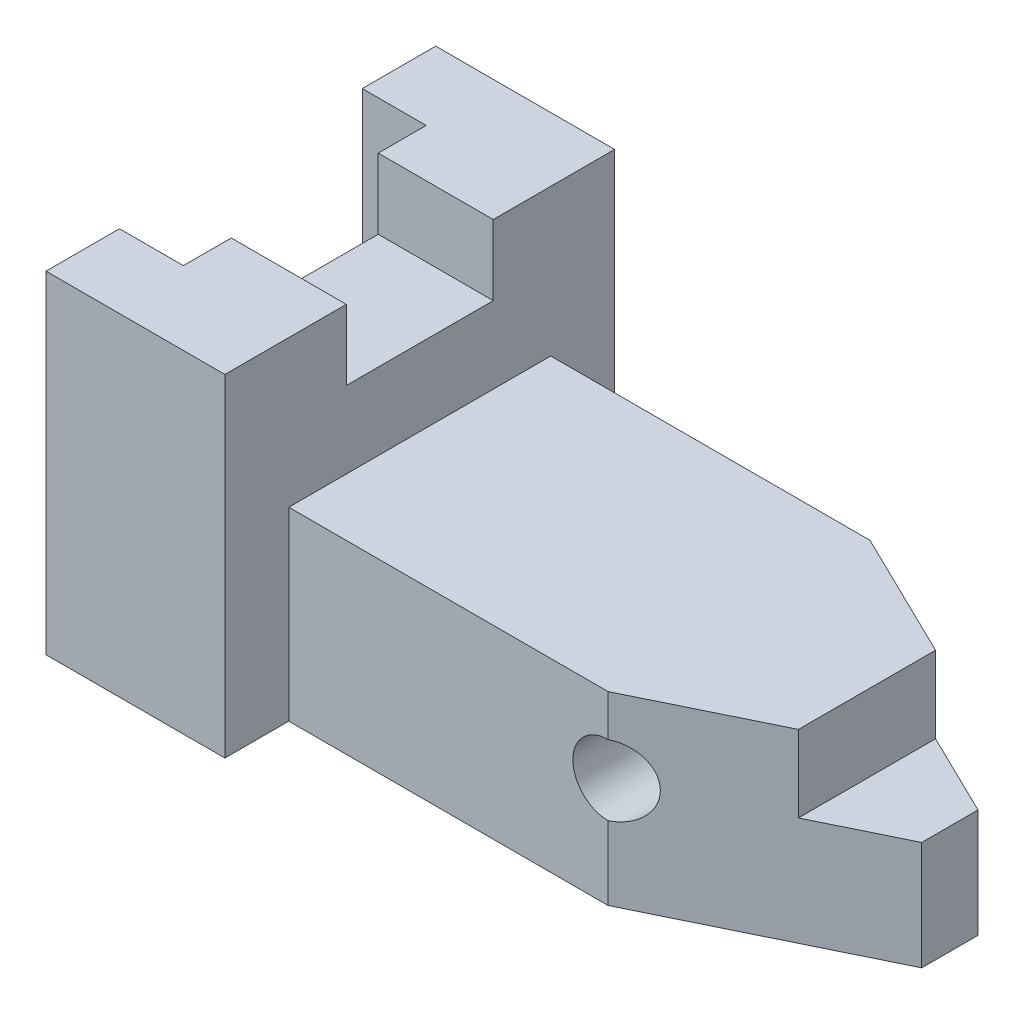
ISO-10303-21;
HEADER;
FILE_DESCRIPTION(('STEP AP214'),'2;1');
FILE_NAME('part.step','',(''),(''),'','','');
FILE_SCHEMA(('AUTOMOTIVE_DESIGN { 1 0 10303 214 1 1 1 1 }'));
ENDSEC;
DATA;
#1=APPLICATION_CONTEXT('core data for automotive mechanical design processes');
#2=APPLICATION_PROTOCOL_DEFINITION('international standard','automotive_design',2000,#1);
#3=PRODUCT_CONTEXT('',#1,'mechanical');
#4=PRODUCT('Part','Part','',(#3));
#5=PRODUCT_RELATED_PRODUCT_CATEGORY('part','',(#4));
#6=PRODUCT_DEFINITION_FORMATION('','',#4);
#7=PRODUCT_DEFINITION_CONTEXT('part definition',#1,'design');
#8=PRODUCT_DEFINITION('design','',#6,#7);
#9=PRODUCT_DEFINITION_SHAPE('','',#8);
#10=(LENGTH_UNIT() NAMED_UNIT(*) SI_UNIT(.MILLI.,.METRE.));
#11=(NAMED_UNIT(*) PLANE_ANGLE_UNIT() SI_UNIT($,.RADIAN.));
#12=(NAMED_UNIT(*) SI_UNIT($,.STERADIAN.) SOLID_ANGLE_UNIT());
#13=UNCERTAINTY_MEASURE_WITH_UNIT(LENGTH_MEASURE(1.E-05),#10,'distance_accuracy_value','');
#14=(GEOMETRIC_REPRESENTATION_CONTEXT(3) GLOBAL_UNCERTAINTY_ASSIGNED_CONTEXT((#13)) GLOBAL_UNIT_ASSIGNED_CONTEXT((#10,
#11,#12)) REPRESENTATION_CONTEXT('',''));
#15=CARTESIAN_POINT('',(0.,0.,0.));
#16=DIRECTION('',(0.,0.,1.));
#17=DIRECTION('',(1.,0.,0.));
#18=AXIS2_PLACEMENT_3D('',#15,#16,#17);
#19=CARTESIAN_POINT('',(0.,41.,0.));
#20=DIRECTION('',(0.,1.,0.));
#21=DIRECTION('',(0.,0.,1.));
#22=AXIS2_PLACEMENT_3D('',#19,#20,#21);
#23=PLANE('',#22);
#24=DIRECTION('',(0.,0.,1.));
#25=VECTOR('',#24,1.);
#26=CARTESIAN_POINT('',(28.,41.,0.));
#27=LINE('',#26,#25);
#28=CARTESIAN_POINT('',(28.,41.,-11.5));
#29=VERTEX_POINT('',#28);
#30=CARTESIAN_POINT('',(28.,41.,11.5));
#31=VERTEX_POINT('',#30);
#32=EDGE_CURVE('E264',#29,#31,#27,.T.);
#33=ORIENTED_EDGE('',*,*,#32,.F.);
#34=DIRECTION('',(-1.,0.,0.));
#35=VECTOR('',#34,1.);
#36=CARTESIAN_POINT('',(0.,41.,-11.5));
#37=LINE('',#36,#35);
#38=CARTESIAN_POINT('',(10.,41.,-11.5));
#39=VERTEX_POINT('',#38);
#40=EDGE_CURVE('E54',#29,#39,#37,.T.);
#41=ORIENTED_EDGE('',*,*,#40,.T.);
#42=DIRECTION('',(0.,0.,-1.));
#43=VECTOR('',#42,1.);
#44=CARTESIAN_POINT('',(10.,41.,0.));
#45=LINE('',#44,#43);
#46=CARTESIAN_POINT('',(10.,41.,11.5));
#47=VERTEX_POINT('',#46);
#48=EDGE_CURVE('E263',#47,#39,#45,.T.);
#49=ORIENTED_EDGE('',*,*,#48,.F.);
#50=DIRECTION('',(-1.,0.,0.));
#51=VECTOR('',#50,1.);
#52=CARTESIAN_POINT('',(0.,41.,11.5));
#53=LINE('',#52,#51);
#54=EDGE_CURVE('E255',#31,#47,#53,.T.);
#55=ORIENTED_EDGE('',*,*,#54,.F.);
#56=EDGE_LOOP('',(#33,#41,#49,#55));
#57=FACE_BOUND('',#56,.T.);
#58=ADVANCED_FACE('F45',(#57),#23,.T.);
#59=CARTESIAN_POINT('',(0.,17.,0.));
#60=DIRECTION('',(0.,1.,0.));
#61=DIRECTION('',(0.,0.,1.));
#62=AXIS2_PLACEMENT_3D('',#59,#60,#61);
#63=PLANE('',#62);
#64=DIRECTION('',(-0.898794046299166,0.,-0.438371146789079));
#65=VECTOR('',#64,1.);
#66=CARTESIAN_POINT('',(23.0603114804606,17.,-47.2806452164034));
#67=LINE('',#66,#65);
#68=CARTESIAN_POINT('',(110.968771247625,17.,-4.40482457732652));
#69=VERTEX_POINT('',#68);
#70=CARTESIAN_POINT('',(98.,17.,-10.730116948449));
#71=VERTEX_POINT('',#70);
#72=EDGE_CURVE('E358',#69,#71,#67,.T.);
#73=ORIENTED_EDGE('',*,*,#72,.T.);
#74=DIRECTION('',(0.,0.,1.));
#75=VECTOR('',#74,1.);
#76=CARTESIAN_POINT('',(98.,17.,0.));
#77=LINE('',#76,#75);
#78=CARTESIAN_POINT('',(98.,17.,10.730116948449));
#79=VERTEX_POINT('',#78);
#80=EDGE_CURVE('E345',#71,#79,#77,.T.);
#81=ORIENTED_EDGE('',*,*,#80,.T.);
#82=DIRECTION('',(-0.898794046299166,0.,0.438371146789079));
#83=VECTOR('',#82,1.);
#84=CARTESIAN_POINT('',(23.0603114804606,17.,47.2806452164034));
#85=LINE('',#84,#83);
#86=CARTESIAN_POINT('',(110.968771247625,17.,4.40482457732652));
#87=VERTEX_POINT('',#86);
#88=EDGE_CURVE('E349',#87,#79,#85,.T.);
#89=ORIENTED_EDGE('',*,*,#88,.F.);
#90=DIRECTION('',(0.,0.,1.));
#91=VECTOR('',#90,1.);
#92=CARTESIAN_POINT('',(110.968771247625,17.,0.));
#93=LINE('',#92,#91);
#94=EDGE_CURVE('E353',#69,#87,#93,.T.);
#95=ORIENTED_EDGE('',*,*,#94,.F.);
#96=EDGE_LOOP('',(#73,#81,#89,#95));
#97=FACE_BOUND('',#96,.T.);
#98=ADVANCED_FACE('F497',(#97),#63,.T.);
#99=CARTESIAN_POINT('',(0.,17.,-20.5));
#100=DIRECTION('',(0.,0.,-1.));
#101=DIRECTION('',(-1.,0.,0.));
#102=AXIS2_PLACEMENT_3D('',#99,#100,#101);
#103=PLANE('',#102);
#104=CARTESIAN_POINT('',(77.9687712476245,17.,-20.5));
#105=DIRECTION('',(0.,0.,-1.));
#106=DIRECTION('',(-1.,0.,0.));
#107=AXIS2_PLACEMENT_3D('',#104,#105,#106);
#108=CIRCLE('',#107,5.5);
#109=CARTESIAN_POINT('',(77.9687712476245,11.5,-20.5));
#110=VERTEX_POINT('',#109);
#111=CARTESIAN_POINT('',(77.9687712476245,22.5,-20.5));
#112=VERTEX_POINT('',#111);
#113=EDGE_CURVE('E67',#110,#112,#108,.T.);
#114=ORIENTED_EDGE('',*,*,#113,.F.);
#115=DIRECTION('',(0.,-1.,0.));
#116=VECTOR('',#115,1.);
#117=CARTESIAN_POINT('',(77.9687712476245,17.,-20.5));
#118=LINE('',#117,#116);
#119=CARTESIAN_POINT('',(77.9687712476245,0.,-20.5));
#120=VERTEX_POINT('',#119);
#121=EDGE_CURVE('E361',#110,#120,#118,.T.);
#122=ORIENTED_EDGE('',*,*,#121,.T.);
#123=DIRECTION('',(1.,0.,0.));
#124=VECTOR('',#123,1.);
#125=CARTESIAN_POINT('',(0.,0.,-20.5));
#126=LINE('',#125,#124);
#127=CARTESIAN_POINT('',(28.,0.,-20.5));
#128=VERTEX_POINT('',#127);
#129=EDGE_CURVE('E348',#128,#120,#126,.T.);
#130=ORIENTED_EDGE('',*,*,#129,.F.);
#131=DIRECTION('',(0.,-1.,0.));
#132=VECTOR('',#131,1.);
#133=CARTESIAN_POINT('',(28.,17.,-20.5));
#134=LINE('',#133,#132);
#135=CARTESIAN_POINT('',(28.,29.,-20.5));
#136=VERTEX_POINT('',#135);
#137=EDGE_CURVE('E249',#136,#128,#134,.T.);
#138=ORIENTED_EDGE('',*,*,#137,.F.);
#139=DIRECTION('',(1.,0.,0.));
#140=VECTOR('',#139,1.);
#141=CARTESIAN_POINT('',(0.,29.,-20.5));
#142=LINE('',#141,#140);
#143=CARTESIAN_POINT('',(77.9687712476245,29.,-20.5));
#144=VERTEX_POINT('',#143);
#145=EDGE_CURVE('E333',#136,#144,#142,.T.);
#146=ORIENTED_EDGE('',*,*,#145,.T.);
#147=EDGE_CURVE('E412',#144,#112,#118,.T.);
#148=ORIENTED_EDGE('',*,*,#147,.T.);
#149=EDGE_LOOP('',(#114,#122,#130,#138,#146,#148));
#150=FACE_BOUND('',#149,.T.);
#151=ADVANCED_FACE('F47',(#150),#103,.T.);
#152=CARTESIAN_POINT('',(0.,17.,-30.5));
#153=DIRECTION('',(0.,0.,-1.));
#154=DIRECTION('',(-1.,0.,0.));
#155=AXIS2_PLACEMENT_3D('',#152,#153,#154);
#156=PLANE('',#155);
#157=DIRECTION('',(1.,0.,0.));
#158=VECTOR('',#157,1.);
#159=CARTESIAN_POINT('',(0.,0.,-30.5));
#160=LINE('',#159,#158);
#161=CARTESIAN_POINT('',(0.,0.,-30.5));
#162=VERTEX_POINT('',#161);
#163=CARTESIAN_POINT('',(28.,0.,-30.5));
#164=VERTEX_POINT('',#163);
#165=EDGE_CURVE('E369',#162,#164,#160,.T.);
#166=ORIENTED_EDGE('',*,*,#165,.F.);
#167=DIRECTION('',(0.,-1.,0.));
#168=VECTOR('',#167,1.);
#169=CARTESIAN_POINT('',(0.,17.,-30.5));
#170=LINE('',#169,#168);
#171=CARTESIAN_POINT('',(0.,52.,-30.5));
#172=VERTEX_POINT('',#171);
#173=EDGE_CURVE('E243',#172,#162,#170,.T.);
#174=ORIENTED_EDGE('',*,*,#173,.F.);
#175=DIRECTION('',(1.,0.,0.));
#176=VECTOR('',#175,1.);
#177=CARTESIAN_POINT('',(0.,52.,-30.5));
#178=LINE('',#177,#176);
#179=CARTESIAN_POINT('',(28.,52.,-30.5));
#180=VERTEX_POINT('',#179);
#181=EDGE_CURVE('E447',#172,#180,#178,.T.);
#182=ORIENTED_EDGE('',*,*,#181,.T.);
#183=DIRECTION('',(0.,-1.,0.));
#184=VECTOR('',#183,1.);
#185=CARTESIAN_POINT('',(28.,17.,-30.5));
#186=LINE('',#185,#184);
#187=EDGE_CURVE('E246',#180,#164,#186,.T.);
#188=ORIENTED_EDGE('',*,*,#187,.T.);
#189=EDGE_LOOP('',(#166,#174,#182,#188));
#190=FACE_BOUND('',#189,.T.);
#191=ADVANCED_FACE('F486',(#190),#156,.T.);
#192=CARTESIAN_POINT('',(0.,17.,0.));
#193=DIRECTION('',(1.,0.,0.));
#194=DIRECTION('',(0.,0.,-1.));
#195=AXIS2_PLACEMENT_3D('',#192,#193,#194);
#196=PLANE('',#195);
#197=DIRECTION('',(0.,0.,1.));
#198=VECTOR('',#197,1.);
#199=CARTESIAN_POINT('',(0.,0.,0.));
#200=LINE('',#199,#198);
#201=CARTESIAN_POINT('',(0.,0.,-19.));
#202=VERTEX_POINT('',#201);
#203=EDGE_CURVE('E373',#162,#202,#200,.T.);
#204=ORIENTED_EDGE('',*,*,#203,.T.);
#205=DIRECTION('',(0.,-1.,0.));
#206=VECTOR('',#205,1.);
#207=CARTESIAN_POINT('',(0.,17.,-19.));
#208=LINE('',#207,#206);
#209=CARTESIAN_POINT('',(0.,52.,-19.));
#210=VERTEX_POINT('',#209);
#211=EDGE_CURVE('E239',#210,#202,#208,.T.);
#212=ORIENTED_EDGE('',*,*,#211,.F.);
#213=DIRECTION('',(0.,0.,1.));
#214=VECTOR('',#213,1.);
#215=CARTESIAN_POINT('',(0.,52.,0.));
#216=LINE('',#215,#214);
#217=EDGE_CURVE('E451',#172,#210,#216,.T.);
#218=ORIENTED_EDGE('',*,*,#217,.F.);
#219=ORIENTED_EDGE('',*,*,#173,.T.);
#220=EDGE_LOOP('',(#204,#212,#218,#219));
#221=FACE_BOUND('',#220,.T.);
#222=ADVANCED_FACE('F488',(#221),#196,.F.);
#223=CARTESIAN_POINT('',(0.,17.,-19.));
#224=DIRECTION('',(0.,0.,-1.));
#225=DIRECTION('',(-1.,0.,0.));
#226=AXIS2_PLACEMENT_3D('',#223,#224,#225);
#227=PLANE('',#226);
#228=DIRECTION('',(1.,0.,0.));
#229=VECTOR('',#228,1.);
#230=CARTESIAN_POINT('',(0.,0.,-19.));
#231=LINE('',#230,#229);
#232=CARTESIAN_POINT('',(10.,0.,-19.));
#233=VERTEX_POINT('',#232);
#234=EDGE_CURVE('E376',#202,#233,#231,.T.);
#235=ORIENTED_EDGE('',*,*,#234,.T.);
#236=DIRECTION('',(0.,-1.,0.));
#237=VECTOR('',#236,1.);
#238=CARTESIAN_POINT('',(10.,17.,-19.));
#239=LINE('',#238,#237);
#240=CARTESIAN_POINT('',(10.,52.,-19.));
#241=VERTEX_POINT('',#240);
#242=EDGE_CURVE('E235',#241,#233,#239,.T.);
#243=ORIENTED_EDGE('',*,*,#242,.F.);
#244=DIRECTION('',(1.,0.,0.));
#245=VECTOR('',#244,1.);
#246=CARTESIAN_POINT('',(0.,52.,-19.));
#247=LINE('',#246,#245);
#248=EDGE_CURVE('E291',#210,#241,#247,.T.);
#249=ORIENTED_EDGE('',*,*,#248,.F.);
#250=ORIENTED_EDGE('',*,*,#211,.T.);
#251=EDGE_LOOP('',(#235,#243,#249,#250));
#252=FACE_BOUND('',#251,.T.);
#253=ADVANCED_FACE('F464',(#252),#227,.F.);
#254=CARTESIAN_POINT('',(10.,17.,0.));
#255=DIRECTION('',(-1.,0.,0.));
#256=DIRECTION('',(0.,0.,1.));
#257=AXIS2_PLACEMENT_3D('',#254,#255,#256);
#258=PLANE('',#257);
#259=ORIENTED_EDGE('',*,*,#242,.T.);
#260=DIRECTION('',(0.,0.,-1.));
#261=VECTOR('',#260,1.);
#262=CARTESIAN_POINT('',(10.,0.,0.));
#263=LINE('',#262,#261);
#264=CARTESIAN_POINT('',(10.,0.,19.));
#265=VERTEX_POINT('',#264);
#266=EDGE_CURVE('E380',#265,#233,#263,.T.);
#267=ORIENTED_EDGE('',*,*,#266,.F.);
#268=DIRECTION('',(0.,-1.,0.));
#269=VECTOR('',#268,1.);
#270=CARTESIAN_POINT('',(10.,17.,19.));
#271=LINE('',#270,#269);
#272=CARTESIAN_POINT('',(10.,52.,19.));
#273=VERTEX_POINT('',#272);
#274=EDGE_CURVE('E232',#273,#265,#271,.T.);
#275=ORIENTED_EDGE('',*,*,#274,.F.);
#276=DIRECTION('',(0.,0.,-1.));
#277=VECTOR('',#276,1.);
#278=CARTESIAN_POINT('',(10.,52.,0.));
#279=LINE('',#278,#277);
#280=CARTESIAN_POINT('',(10.,52.,11.5));
#281=VERTEX_POINT('',#280);
#282=EDGE_CURVE('E289',#273,#281,#279,.T.);
#283=ORIENTED_EDGE('',*,*,#282,.T.);
#284=DIRECTION('',(0.,-1.,0.));
#285=VECTOR('',#284,1.);
#286=CARTESIAN_POINT('',(10.,52.,11.5));
#287=LINE('',#286,#285);
#288=EDGE_CURVE('E276',#281,#47,#287,.T.);
#289=ORIENTED_EDGE('',*,*,#288,.T.);
#290=ORIENTED_EDGE('',*,*,#48,.T.);
#291=DIRECTION('',(0.,-1.,0.));
#292=VECTOR('',#291,1.);
#293=CARTESIAN_POINT('',(10.,52.,-11.5));
#294=LINE('',#293,#292);
#295=CARTESIAN_POINT('',(10.,52.,-11.5));
#296=VERTEX_POINT('',#295);
#297=EDGE_CURVE('E273',#296,#39,#294,.T.);
#298=ORIENTED_EDGE('',*,*,#297,.F.);
#299=DIRECTION('',(0.,0.,-1.));
#300=VECTOR('',#299,1.);
#301=CARTESIAN_POINT('',(10.,52.,0.));
#302=LINE('',#301,#300);
#303=EDGE_CURVE('E197',#296,#241,#302,.T.);
#304=ORIENTED_EDGE('',*,*,#303,.T.);
#305=EDGE_LOOP('',(#259,#267,#275,#283,#289,#290,#298,#304));
#306=FACE_BOUND('',#305,.T.);
#307=ADVANCED_FACE('F271',(#306),#258,.T.);
#308=CARTESIAN_POINT('',(0.,17.,19.));
#309=DIRECTION('',(0.,0.,-1.));
#310=DIRECTION('',(-1.,0.,0.));
#311=AXIS2_PLACEMENT_3D('',#308,#309,#310);
#312=PLANE('',#311);
#313=DIRECTION('',(1.,0.,0.));
#314=VECTOR('',#313,1.);
#315=CARTESIAN_POINT('',(0.,0.,19.));
#316=LINE('',#315,#314);
#317=CARTESIAN_POINT('',(0.,0.,19.));
#318=VERTEX_POINT('',#317);
#319=EDGE_CURVE('E383',#318,#265,#316,.T.);
#320=ORIENTED_EDGE('',*,*,#319,.F.);
#321=DIRECTION('',(0.,-1.,0.));
#322=VECTOR('',#321,1.);
#323=CARTESIAN_POINT('',(0.,17.,19.));
#324=LINE('',#323,#322);
#325=CARTESIAN_POINT('',(0.,52.,19.));
#326=VERTEX_POINT('',#325);
#327=EDGE_CURVE('E229',#326,#318,#324,.T.);
#328=ORIENTED_EDGE('',*,*,#327,.F.);
#329=DIRECTION('',(1.,0.,0.));
#330=VECTOR('',#329,1.);
#331=CARTESIAN_POINT('',(0.,52.,19.));
#332=LINE('',#331,#330);
#333=EDGE_CURVE('E297',#326,#273,#332,.T.);
#334=ORIENTED_EDGE('',*,*,#333,.T.);
#335=ORIENTED_EDGE('',*,*,#274,.T.);
#336=EDGE_LOOP('',(#320,#328,#334,#335));
#337=FACE_BOUND('',#336,.T.);
#338=ADVANCED_FACE('F471',(#337),#312,.T.);
#339=CARTESIAN_POINT('',(0.,17.,0.));
#340=DIRECTION('',(1.,0.,0.));
#341=DIRECTION('',(0.,0.,-1.));
#342=AXIS2_PLACEMENT_3D('',#339,#340,#341);
#343=PLANE('',#342);
#344=DIRECTION('',(0.,0.,1.));
#345=VECTOR('',#344,1.);
#346=CARTESIAN_POINT('',(0.,0.,0.));
#347=LINE('',#346,#345);
#348=CARTESIAN_POINT('',(0.,0.,30.5));
#349=VERTEX_POINT('',#348);
#350=EDGE_CURVE('E387',#318,#349,#347,.T.);
#351=ORIENTED_EDGE('',*,*,#350,.T.);
#352=DIRECTION('',(0.,-1.,0.));
#353=VECTOR('',#352,1.);
#354=CARTESIAN_POINT('',(0.,17.,30.5));
#355=LINE('',#354,#353);
#356=CARTESIAN_POINT('',(0.,52.,30.5));
#357=VERTEX_POINT('',#356);
#358=EDGE_CURVE('E225',#357,#349,#355,.T.);
#359=ORIENTED_EDGE('',*,*,#358,.F.);
#360=DIRECTION('',(0.,0.,1.));
#361=VECTOR('',#360,1.);
#362=CARTESIAN_POINT('',(0.,52.,0.));
#363=LINE('',#362,#361);
#364=EDGE_CURVE('E301',#326,#357,#363,.T.);
#365=ORIENTED_EDGE('',*,*,#364,.F.);
#366=ORIENTED_EDGE('',*,*,#327,.T.);
#367=EDGE_LOOP('',(#351,#359,#365,#366));
#368=FACE_BOUND('',#367,.T.);
#369=ADVANCED_FACE('F530',(#368),#343,.F.);
#370=CARTESIAN_POINT('',(0.,17.,30.5));
#371=DIRECTION('',(0.,0.,-1.));
#372=DIRECTION('',(-1.,0.,0.));
#373=AXIS2_PLACEMENT_3D('',#370,#371,#372);
#374=PLANE('',#373);
#375=DIRECTION('',(1.,0.,0.));
#376=VECTOR('',#375,1.);
#377=CARTESIAN_POINT('',(0.,0.,30.5));
#378=LINE('',#377,#376);
#379=CARTESIAN_POINT('',(28.,0.,30.5));
#380=VERTEX_POINT('',#379);
#381=EDGE_CURVE('E390',#349,#380,#378,.T.);
#382=ORIENTED_EDGE('',*,*,#381,.T.);
#383=DIRECTION('',(0.,-1.,0.));
#384=VECTOR('',#383,1.);
#385=CARTESIAN_POINT('',(28.,17.,30.5));
#386=LINE('',#385,#384);
#387=CARTESIAN_POINT('',(28.,52.,30.5));
#388=VERTEX_POINT('',#387);
#389=EDGE_CURVE('E217',#388,#380,#386,.T.);
#390=ORIENTED_EDGE('',*,*,#389,.F.);
#391=DIRECTION('',(1.,0.,0.));
#392=VECTOR('',#391,1.);
#393=CARTESIAN_POINT('',(0.,52.,30.5));
#394=LINE('',#393,#392);
#395=EDGE_CURVE('E305',#357,#388,#394,.T.);
#396=ORIENTED_EDGE('',*,*,#395,.F.);
#397=ORIENTED_EDGE('',*,*,#358,.T.);
#398=EDGE_LOOP('',(#382,#390,#396,#397));
#399=FACE_BOUND('',#398,.T.);
#400=ADVANCED_FACE('F527',(#399),#374,.F.);
#401=CARTESIAN_POINT('',(28.,17.,0.));
#402=DIRECTION('',(1.,0.,0.));
#403=DIRECTION('',(0.,0.,-1.));
#404=AXIS2_PLACEMENT_3D('',#401,#402,#403);
#405=PLANE('',#404);
#406=DIRECTION('',(0.,-1.,0.));
#407=VECTOR('',#406,1.);
#408=CARTESIAN_POINT('',(28.,52.,-11.5));
#409=LINE('',#408,#407);
#410=CARTESIAN_POINT('',(28.,52.,-11.5));
#411=VERTEX_POINT('',#410);
#412=EDGE_CURVE('E284',#411,#29,#409,.T.);
#413=ORIENTED_EDGE('',*,*,#412,.T.);
#414=ORIENTED_EDGE('',*,*,#32,.T.);
#415=DIRECTION('',(0.,-1.,0.));
#416=VECTOR('',#415,1.);
#417=CARTESIAN_POINT('',(28.,52.,11.5));
#418=LINE('',#417,#416);
#419=CARTESIAN_POINT('',(28.,52.,11.5));
#420=VERTEX_POINT('',#419);
#421=EDGE_CURVE('E313',#420,#31,#418,.T.);
#422=ORIENTED_EDGE('',*,*,#421,.F.);
#423=DIRECTION('',(0.,0.,1.));
#424=VECTOR('',#423,1.);
#425=CARTESIAN_POINT('',(28.,52.,0.));
#426=LINE('',#425,#424);
#427=EDGE_CURVE('E309',#420,#388,#426,.T.);
#428=ORIENTED_EDGE('',*,*,#427,.T.);
#429=ORIENTED_EDGE('',*,*,#389,.T.);
#430=DIRECTION('',(0.,0.,1.));
#431=VECTOR('',#430,1.);
#432=CARTESIAN_POINT('',(28.,0.,0.));
#433=LINE('',#432,#431);
#434=CARTESIAN_POINT('',(28.,0.,20.5));
#435=VERTEX_POINT('',#434);
#436=EDGE_CURVE('E394',#435,#380,#433,.T.);
#437=ORIENTED_EDGE('',*,*,#436,.F.);
#438=DIRECTION('',(0.,-1.,0.));
#439=VECTOR('',#438,1.);
#440=CARTESIAN_POINT('',(28.,17.,20.5));
#441=LINE('',#440,#439);
#442=CARTESIAN_POINT('',(28.,29.,20.5));
#443=VERTEX_POINT('',#442);
#444=EDGE_CURVE('E213',#443,#435,#441,.T.);
#445=ORIENTED_EDGE('',*,*,#444,.F.);
#446=DIRECTION('',(0.,0.,-1.));
#447=VECTOR('',#446,1.);
#448=CARTESIAN_POINT('',(28.,29.,0.));
#449=LINE('',#448,#447);
#450=EDGE_CURVE('E252',#443,#136,#449,.T.);
#451=ORIENTED_EDGE('',*,*,#450,.T.);
#452=ORIENTED_EDGE('',*,*,#137,.T.);
#453=DIRECTION('',(0.,0.,1.));
#454=VECTOR('',#453,1.);
#455=CARTESIAN_POINT('',(28.,0.,0.));
#456=LINE('',#455,#454);
#457=EDGE_CURVE('E365',#164,#128,#456,.T.);
#458=ORIENTED_EDGE('',*,*,#457,.F.);
#459=ORIENTED_EDGE('',*,*,#187,.F.);
#460=DIRECTION('',(0.,0.,1.));
#461=VECTOR('',#460,1.);
#462=CARTESIAN_POINT('',(28.,52.,0.));
#463=LINE('',#462,#461);
#464=EDGE_CURVE('E443',#180,#411,#463,.T.);
#465=ORIENTED_EDGE('',*,*,#464,.T.);
#466=EDGE_LOOP('',(#413,#414,#422,#428,#429,#437,#445,#451,#452,#458,#459,#465));
#467=FACE_BOUND('',#466,.T.);
#468=ADVANCED_FACE('F482',(#467),#405,.T.);
#469=CARTESIAN_POINT('',(0.,17.,20.5));
#470=DIRECTION('',(0.,0.,-1.));
#471=DIRECTION('',(-1.,0.,0.));
#472=AXIS2_PLACEMENT_3D('',#469,#470,#471);
#473=PLANE('',#472);
#474=DIRECTION('',(0.,-1.,0.));
#475=VECTOR('',#474,1.);
#476=CARTESIAN_POINT('',(77.9687712476245,17.,20.5));
#477=LINE('',#476,#475);
#478=CARTESIAN_POINT('',(77.9687712476245,11.5,20.5));
#479=VERTEX_POINT('',#478);
#480=CARTESIAN_POINT('',(77.9687712476245,0.,20.5));
#481=VERTEX_POINT('',#480);
#482=EDGE_CURVE('E205',#479,#481,#477,.T.);
#483=ORIENTED_EDGE('',*,*,#482,.F.);
#484=CARTESIAN_POINT('',(77.9687712476245,17.,20.5));
#485=DIRECTION('',(0.,0.,1.));
#486=DIRECTION('',(1.,0.,0.));
#487=AXIS2_PLACEMENT_3D('',#484,#485,#486);
#488=CIRCLE('',#487,5.5);
#489=CARTESIAN_POINT('',(77.9687712476246,22.5,20.5));
#490=VERTEX_POINT('',#489);
#491=EDGE_CURVE('E60',#490,#479,#488,.T.);
#492=ORIENTED_EDGE('',*,*,#491,.F.);
#493=CARTESIAN_POINT('',(77.9687712476245,29.,20.5));
#494=VERTEX_POINT('',#493);
#495=EDGE_CURVE('E202',#494,#490,#477,.T.);
#496=ORIENTED_EDGE('',*,*,#495,.F.);
#497=DIRECTION('',(1.,0.,0.));
#498=VECTOR('',#497,1.);
#499=CARTESIAN_POINT('',(0.,29.,20.5));
#500=LINE('',#499,#498);
#501=EDGE_CURVE('E321',#443,#494,#500,.T.);
#502=ORIENTED_EDGE('',*,*,#501,.F.);
#503=ORIENTED_EDGE('',*,*,#444,.T.);
#504=DIRECTION('',(1.,0.,0.));
#505=VECTOR('',#504,1.);
#506=CARTESIAN_POINT('',(0.,0.,20.5));
#507=LINE('',#506,#505);
#508=EDGE_CURVE('E398',#435,#481,#507,.T.);
#509=ORIENTED_EDGE('',*,*,#508,.T.);
#510=EDGE_LOOP('',(#483,#492,#496,#502,#503,#509));
#511=FACE_BOUND('',#510,.T.);
#512=ADVANCED_FACE('F200',(#511),#473,.F.);
#513=CARTESIAN_POINT('',(23.0603114804606,17.,47.2806452164034));
#514=DIRECTION('',(0.438371146789079,0.,0.898794046299166));
#515=DIRECTION('',(0.898794046299166,0.,-0.438371146789079));
#516=AXIS2_PLACEMENT_3D('',#513,#514,#515);
#517=PLANE('',#516);
#518=CARTESIAN_POINT('',(77.9687712476245,17.,20.5));
#519=DIRECTION('',(0.438371146789079,0.,0.898794046299166));
#520=DIRECTION('',(-0.898794046299166,0.,0.438371146789079));
#521=AXIS2_PLACEMENT_3D('',#518,#519,#520);
#522=ELLIPSE('',#521,6.11931067261355,5.5);
#523=EDGE_CURVE('E191',#479,#490,#522,.T.);
#524=ORIENTED_EDGE('',*,*,#523,.F.);
#525=ORIENTED_EDGE('',*,*,#482,.T.);
#526=DIRECTION('',(-0.898794046299166,0.,0.438371146789079));
#527=VECTOR('',#526,1.);
#528=CARTESIAN_POINT('',(23.0603114804606,0.,47.2806452164034));
#529=LINE('',#528,#527);
#530=CARTESIAN_POINT('',(110.968771247625,0.,4.40482457732652));
#531=VERTEX_POINT('',#530);
#532=EDGE_CURVE('E401',#531,#481,#529,.T.);
#533=ORIENTED_EDGE('',*,*,#532,.F.);
#534=DIRECTION('',(0.,-1.,0.));
#535=VECTOR('',#534,1.);
#536=CARTESIAN_POINT('',(110.968771247625,17.,4.40482457732652));
#537=LINE('',#536,#535);
#538=EDGE_CURVE('E219',#87,#531,#537,.T.);
#539=ORIENTED_EDGE('',*,*,#538,.F.);
#540=ORIENTED_EDGE('',*,*,#88,.T.);
#541=DIRECTION('',(0.,-1.,0.));
#542=VECTOR('',#541,1.);
#543=CARTESIAN_POINT('',(98.,29.,10.730116948449));
#544=LINE('',#543,#542);
#545=CARTESIAN_POINT('',(98.,29.,10.730116948449));
#546=VERTEX_POINT('',#545);
#547=EDGE_CURVE('E341',#546,#79,#544,.T.);
#548=ORIENTED_EDGE('',*,*,#547,.F.);
#549=DIRECTION('',(-0.898794046299166,0.,0.438371146789079));
#550=VECTOR('',#549,1.);
#551=CARTESIAN_POINT('',(23.0603114804606,29.,47.2806452164034));
#552=LINE('',#551,#550);
#553=EDGE_CURVE('E211',#546,#494,#552,.T.);
#554=ORIENTED_EDGE('',*,*,#553,.T.);
#555=ORIENTED_EDGE('',*,*,#495,.T.);
#556=EDGE_LOOP('',(#524,#525,#533,#539,#540,#548,#554,#555));
#557=FACE_BOUND('',#556,.T.);
#558=ADVANCED_FACE('F209',(#557),#517,.T.);
#559=CARTESIAN_POINT('',(110.968771247625,17.,0.));
#560=DIRECTION('',(1.,0.,0.));
#561=DIRECTION('',(0.,0.,-1.));
#562=AXIS2_PLACEMENT_3D('',#559,#560,#561);
#563=PLANE('',#562);
#564=DIRECTION('',(0.,0.,1.));
#565=VECTOR('',#564,1.);
#566=CARTESIAN_POINT('',(110.968771247625,0.,0.));
#567=LINE('',#566,#565);
#568=CARTESIAN_POINT('',(110.968771247625,0.,-4.40482457732652));
#569=VERTEX_POINT('',#568);
#570=EDGE_CURVE('E405',#569,#531,#567,.T.);
#571=ORIENTED_EDGE('',*,*,#570,.F.);
#572=DIRECTION('',(0.,-1.,0.));
#573=VECTOR('',#572,1.);
#574=CARTESIAN_POINT('',(110.968771247625,17.,-4.40482457732652));
#575=LINE('',#574,#573);
#576=EDGE_CURVE('E415',#69,#569,#575,.T.);
#577=ORIENTED_EDGE('',*,*,#576,.F.);
#578=ORIENTED_EDGE('',*,*,#94,.T.);
#579=ORIENTED_EDGE('',*,*,#538,.T.);
#580=EDGE_LOOP('',(#571,#577,#578,#579));
#581=FACE_BOUND('',#580,.T.);
#582=ADVANCED_FACE('F424',(#581),#563,.T.);
#583=CARTESIAN_POINT('',(23.0603114804606,17.,-47.2806452164034));
#584=DIRECTION('',(-0.438371146789079,0.,0.898794046299166));
#585=DIRECTION('',(0.898794046299166,0.,0.438371146789079));
#586=AXIS2_PLACEMENT_3D('',#583,#584,#585);
#587=PLANE('',#586);
#588=ORIENTED_EDGE('',*,*,#121,.F.);
#589=CARTESIAN_POINT('',(77.9687712476245,17.,-20.5));
#590=DIRECTION('',(-0.438371146789079,0.,0.898794046299166));
#591=DIRECTION('',(0.898794046299166,0.,0.438371146789079));
#592=AXIS2_PLACEMENT_3D('',#589,#590,#591);
#593=ELLIPSE('',#592,6.11931067261355,5.5);
#594=EDGE_CURVE('E11',#110,#112,#593,.T.);
#595=ORIENTED_EDGE('',*,*,#594,.T.);
#596=ORIENTED_EDGE('',*,*,#147,.F.);
#597=DIRECTION('',(-0.898794046299166,0.,-0.438371146789079));
#598=VECTOR('',#597,1.);
#599=CARTESIAN_POINT('',(23.0603114804606,29.,-47.2806452164034));
#600=LINE('',#599,#598);
#601=CARTESIAN_POINT('',(98.,29.,-10.730116948449));
#602=VERTEX_POINT('',#601);
#603=EDGE_CURVE('E329',#602,#144,#600,.T.);
#604=ORIENTED_EDGE('',*,*,#603,.F.);
#605=DIRECTION('',(0.,-1.,0.));
#606=VECTOR('',#605,1.);
#607=CARTESIAN_POINT('',(98.,29.,-10.730116948449));
#608=LINE('',#607,#606);
#609=EDGE_CURVE('E337',#602,#71,#608,.T.);
#610=ORIENTED_EDGE('',*,*,#609,.T.);
#611=ORIENTED_EDGE('',*,*,#72,.F.);
#612=ORIENTED_EDGE('',*,*,#576,.T.);
#613=DIRECTION('',(-0.898794046299166,0.,-0.438371146789079));
#614=VECTOR('',#613,1.);
#615=CARTESIAN_POINT('',(23.0603114804606,0.,-47.2806452164034));
#616=LINE('',#615,#614);
#617=EDGE_CURVE('E354',#569,#120,#616,.T.);
#618=ORIENTED_EDGE('',*,*,#617,.T.);
#619=EDGE_LOOP('',(#588,#595,#596,#604,#610,#611,#612,#618));
#620=FACE_BOUND('',#619,.T.);
#621=ADVANCED_FACE('F432',(#620),#587,.F.);
#622=CARTESIAN_POINT('',(0.,0.,0.));
#623=DIRECTION('',(0.,1.,0.));
#624=DIRECTION('',(0.,0.,1.));
#625=AXIS2_PLACEMENT_3D('',#622,#623,#624);
#626=PLANE('',#625);
#627=ORIENTED_EDGE('',*,*,#266,.T.);
#628=ORIENTED_EDGE('',*,*,#234,.F.);
#629=ORIENTED_EDGE('',*,*,#203,.F.);
#630=ORIENTED_EDGE('',*,*,#165,.T.);
#631=ORIENTED_EDGE('',*,*,#457,.T.);
#632=ORIENTED_EDGE('',*,*,#129,.T.);
#633=ORIENTED_EDGE('',*,*,#617,.F.);
#634=ORIENTED_EDGE('',*,*,#570,.T.);
#635=ORIENTED_EDGE('',*,*,#532,.T.);
#636=ORIENTED_EDGE('',*,*,#508,.F.);
#637=ORIENTED_EDGE('',*,*,#436,.T.);
#638=ORIENTED_EDGE('',*,*,#381,.F.);
#639=ORIENTED_EDGE('',*,*,#350,.F.);
#640=ORIENTED_EDGE('',*,*,#319,.T.);
#641=EDGE_LOOP('',(#627,#628,#629,#630,#631,#632,#633,#634,#635,#636,#637,#638,#639,#640));
#642=FACE_BOUND('',#641,.T.);
#643=ADVANCED_FACE('F429',(#642),#626,.F.);
#644=CARTESIAN_POINT('',(98.,29.,0.));
#645=DIRECTION('',(-1.,0.,0.));
#646=DIRECTION('',(0.,0.,1.));
#647=AXIS2_PLACEMENT_3D('',#644,#645,#646);
#648=PLANE('',#647);
#649=ORIENTED_EDGE('',*,*,#80,.F.);
#650=ORIENTED_EDGE('',*,*,#609,.F.);
#651=DIRECTION('',(0.,0.,-1.));
#652=VECTOR('',#651,1.);
#653=CARTESIAN_POINT('',(98.,29.,0.));
#654=LINE('',#653,#652);
#655=EDGE_CURVE('E326',#546,#602,#654,.T.);
#656=ORIENTED_EDGE('',*,*,#655,.F.);
#657=ORIENTED_EDGE('',*,*,#547,.T.);
#658=EDGE_LOOP('',(#649,#650,#656,#657));
#659=FACE_BOUND('',#658,.T.);
#660=ADVANCED_FACE('F510',(#659),#648,.F.);
#661=CARTESIAN_POINT('',(0.,29.,0.));
#662=DIRECTION('',(0.,1.,0.));
#663=DIRECTION('',(0.,0.,1.));
#664=AXIS2_PLACEMENT_3D('',#661,#662,#663);
#665=PLANE('',#664);
#666=ORIENTED_EDGE('',*,*,#450,.F.);
#667=ORIENTED_EDGE('',*,*,#501,.T.);
#668=ORIENTED_EDGE('',*,*,#553,.F.);
#669=ORIENTED_EDGE('',*,*,#655,.T.);
#670=ORIENTED_EDGE('',*,*,#603,.T.);
#671=ORIENTED_EDGE('',*,*,#145,.F.);
#672=EDGE_LOOP('',(#666,#667,#668,#669,#670,#671));
#673=FACE_BOUND('',#672,.T.);
#674=ADVANCED_FACE('F507',(#673),#665,.T.);
#675=CARTESIAN_POINT('',(0.,52.,11.5));
#676=DIRECTION('',(0.,0.,-1.));
#677=DIRECTION('',(-1.,0.,0.));
#678=AXIS2_PLACEMENT_3D('',#675,#676,#677);
#679=PLANE('',#678);
#680=ORIENTED_EDGE('',*,*,#421,.T.);
#681=ORIENTED_EDGE('',*,*,#54,.T.);
#682=ORIENTED_EDGE('',*,*,#288,.F.);
#683=DIRECTION('',(1.,0.,0.));
#684=VECTOR('',#683,1.);
#685=CARTESIAN_POINT('',(0.,52.,11.5));
#686=LINE('',#685,#684);
#687=EDGE_CURVE('E283',#281,#420,#686,.T.);
#688=ORIENTED_EDGE('',*,*,#687,.T.);
#689=EDGE_LOOP('',(#680,#681,#682,#688));
#690=FACE_BOUND('',#689,.T.);
#691=ADVANCED_FACE('F480',(#690),#679,.T.);
#692=CARTESIAN_POINT('',(0.,52.,0.));
#693=DIRECTION('',(0.,1.,0.));
#694=DIRECTION('',(0.,0.,1.));
#695=AXIS2_PLACEMENT_3D('',#692,#693,#694);
#696=PLANE('',#695);
#697=ORIENTED_EDGE('',*,*,#687,.F.);
#698=ORIENTED_EDGE('',*,*,#282,.F.);
#699=ORIENTED_EDGE('',*,*,#333,.F.);
#700=ORIENTED_EDGE('',*,*,#364,.T.);
#701=ORIENTED_EDGE('',*,*,#395,.T.);
#702=ORIENTED_EDGE('',*,*,#427,.F.);
#703=EDGE_LOOP('',(#697,#698,#699,#700,#701,#702));
#704=FACE_BOUND('',#703,.T.);
#705=ADVANCED_FACE('F477',(#704),#696,.T.);
#706=CARTESIAN_POINT('',(0.,52.,-11.5));
#707=DIRECTION('',(0.,0.,-1.));
#708=DIRECTION('',(-1.,0.,0.));
#709=AXIS2_PLACEMENT_3D('',#706,#707,#708);
#710=PLANE('',#709);
#711=ORIENTED_EDGE('',*,*,#40,.F.);
#712=ORIENTED_EDGE('',*,*,#412,.F.);
#713=DIRECTION('',(1.,0.,0.));
#714=VECTOR('',#713,1.);
#715=CARTESIAN_POINT('',(0.,52.,-11.5));
#716=LINE('',#715,#714);
#717=EDGE_CURVE('E280',#296,#411,#716,.T.);
#718=ORIENTED_EDGE('',*,*,#717,.F.);
#719=ORIENTED_EDGE('',*,*,#297,.T.);
#720=EDGE_LOOP('',(#711,#712,#718,#719));
#721=FACE_BOUND('',#720,.T.);
#722=ADVANCED_FACE('F279',(#721),#710,.F.);
#723=CARTESIAN_POINT('',(0.,52.,0.));
#724=DIRECTION('',(0.,1.,0.));
#725=DIRECTION('',(0.,0.,1.));
#726=AXIS2_PLACEMENT_3D('',#723,#724,#725);
#727=PLANE('',#726);
#728=ORIENTED_EDGE('',*,*,#303,.F.);
#729=ORIENTED_EDGE('',*,*,#717,.T.);
#730=ORIENTED_EDGE('',*,*,#464,.F.);
#731=ORIENTED_EDGE('',*,*,#181,.F.);
#732=ORIENTED_EDGE('',*,*,#217,.T.);
#733=ORIENTED_EDGE('',*,*,#248,.T.);
#734=EDGE_LOOP('',(#728,#729,#730,#731,#732,#733));
#735=FACE_BOUND('',#734,.T.);
#736=ADVANCED_FACE('F458',(#735),#727,.T.);
#737=CARTESIAN_POINT('',(77.9687712476245,17.,-30.5));
#738=DIRECTION('',(0.,0.,1.));
#739=DIRECTION('',(1.,0.,0.));
#740=AXIS2_PLACEMENT_3D('',#737,#738,#739);
#741=CYLINDRICAL_SURFACE('',#740,5.5);
#742=ORIENTED_EDGE('',*,*,#523,.T.);
#743=ORIENTED_EDGE('',*,*,#491,.T.);
#744=EDGE_LOOP('',(#742,#743));
#745=FACE_BOUND('',#744,.T.);
#746=ORIENTED_EDGE('',*,*,#113,.T.);
#747=ORIENTED_EDGE('',*,*,#594,.F.);
#748=EDGE_LOOP('',(#746,#747));
#749=FACE_BOUND('',#748,.T.);
#750=ADVANCED_FACE('F192',(#745,#749),#741,.F.);
#751=CLOSED_SHELL('',(#58,#98,#151,#191,#222,#253,#307,#338,#369,#400,#468,#512,#558,#582,#621,
#643,#660,#674,#691,#705,#722,#736,#750));
#752=MANIFOLD_SOLID_BREP('B2',#751);
#753=ADVANCED_BREP_SHAPE_REPRESENTATION('',(#18,#752),#14);
#754=SHAPE_DEFINITION_REPRESENTATION(#9,#753);
ENDSEC;
END-ISO-10303-21;
